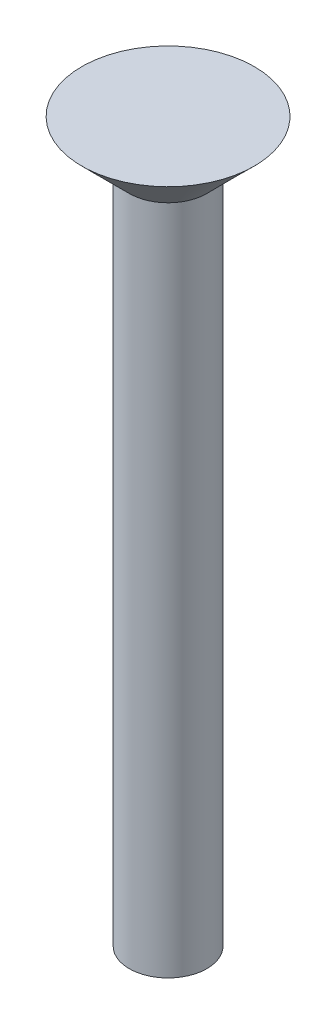
ISO-10303-21;
HEADER;
FILE_DESCRIPTION(('STEP AP214'),'2;1');
FILE_NAME('part.step','',(''),(''),'','','');
FILE_SCHEMA(('AUTOMOTIVE_DESIGN { 1 0 10303 214 1 1 1 1 }'));
ENDSEC;
DATA;
#1=APPLICATION_CONTEXT('core data for automotive mechanical design processes');
#2=APPLICATION_PROTOCOL_DEFINITION('international standard','automotive_design',2000,#1);
#3=PRODUCT_CONTEXT('',#1,'mechanical');
#4=PRODUCT('Part','Part','',(#3));
#5=PRODUCT_RELATED_PRODUCT_CATEGORY('part','',(#4));
#6=PRODUCT_DEFINITION_FORMATION('','',#4);
#7=PRODUCT_DEFINITION_CONTEXT('part definition',#1,'design');
#8=PRODUCT_DEFINITION('design','',#6,#7);
#9=PRODUCT_DEFINITION_SHAPE('','',#8);
#10=(LENGTH_UNIT() NAMED_UNIT(*) SI_UNIT(.MILLI.,.METRE.));
#11=(NAMED_UNIT(*) PLANE_ANGLE_UNIT() SI_UNIT($,.RADIAN.));
#12=(NAMED_UNIT(*) SI_UNIT($,.STERADIAN.) SOLID_ANGLE_UNIT());
#13=UNCERTAINTY_MEASURE_WITH_UNIT(LENGTH_MEASURE(1.E-05),#10,'distance_accuracy_value','');
#14=(GEOMETRIC_REPRESENTATION_CONTEXT(3) GLOBAL_UNCERTAINTY_ASSIGNED_CONTEXT((#13)) GLOBAL_UNIT_ASSIGNED_CONTEXT((#10,
#11,#12)) REPRESENTATION_CONTEXT('',''));
#15=CARTESIAN_POINT('',(0.,0.,0.));
#16=DIRECTION('',(0.,0.,1.));
#17=DIRECTION('',(1.,0.,0.));
#18=AXIS2_PLACEMENT_3D('',#15,#16,#17);
#19=CARTESIAN_POINT('',(1.35,-11.675,0.));
#20=DIRECTION('',(0.,-1.,0.));
#21=DIRECTION('',(0.,0.,-1.));
#22=AXIS2_PLACEMENT_3D('',#19,#20,#21);
#23=PLANE('',#22);
#24=CARTESIAN_POINT('',(0.,-11.675,0.));
#25=DIRECTION('',(0.,-1.,0.));
#26=DIRECTION('',(0.,0.,-1.));
#27=AXIS2_PLACEMENT_3D('',#24,#25,#26);
#28=CIRCLE('',#27,1.35);
#29=CARTESIAN_POINT('',(0.,-11.675,-1.35));
#30=VERTEX_POINT('',#29);
#31=EDGE_CURVE('E10',#30,#30,#28,.T.);
#32=ORIENTED_EDGE('',*,*,#31,.T.);
#33=EDGE_LOOP('',(#32));
#34=FACE_BOUND('',#33,.T.);
#35=ADVANCED_FACE('F37',(#34),#23,.T.);
#36=CARTESIAN_POINT('',(0.,-5.70664739884393,0.));
#37=DIRECTION('',(0.,-1.,0.));
#38=DIRECTION('',(0.,0.,-1.));
#39=AXIS2_PLACEMENT_3D('',#36,#37,#38);
#40=CYLINDRICAL_SURFACE('',#39,1.35);
#41=CARTESIAN_POINT('',(0.,11.675,0.));
#42=DIRECTION('',(0.,-1.,0.));
#43=DIRECTION('',(0.,0.,-1.));
#44=AXIS2_PLACEMENT_3D('',#41,#42,#43);
#45=CIRCLE('',#44,1.35);
#46=CARTESIAN_POINT('',(0.,11.675,-1.35));
#47=VERTEX_POINT('',#46);
#48=EDGE_CURVE('E44',#47,#47,#45,.T.);
#49=ORIENTED_EDGE('',*,*,#48,.T.);
#50=EDGE_LOOP('',(#49));
#51=FACE_BOUND('',#50,.T.);
#52=ORIENTED_EDGE('',*,*,#31,.F.);
#53=EDGE_LOOP('',(#52));
#54=FACE_BOUND('',#53,.T.);
#55=ADVANCED_FACE('F62',(#51,#54),#40,.T.);
#56=CARTESIAN_POINT('',(3.,13.325,0.));
#57=DIRECTION('',(0.,1.,0.));
#58=DIRECTION('',(0.,0.,1.));
#59=AXIS2_PLACEMENT_3D('',#56,#57,#58);
#60=PLANE('',#59);
#61=CARTESIAN_POINT('',(0.,13.325,0.));
#62=DIRECTION('',(0.,-1.,0.));
#63=DIRECTION('',(0.,0.,-1.));
#64=AXIS2_PLACEMENT_3D('',#61,#62,#63);
#65=CIRCLE('',#64,3.);
#66=CARTESIAN_POINT('',(0.,13.325,-3.));
#67=VERTEX_POINT('',#66);
#68=EDGE_CURVE('E49',#67,#67,#65,.T.);
#69=ORIENTED_EDGE('',*,*,#68,.F.);
#70=EDGE_LOOP('',(#69));
#71=FACE_BOUND('',#70,.T.);
#72=ADVANCED_FACE('F60',(#71),#60,.T.);
#73=CARTESIAN_POINT('',(0.,11.675,0.));
#74=DIRECTION('',(0.,1.,0.));
#75=DIRECTION('',(0.,0.,1.));
#76=AXIS2_PLACEMENT_3D('',#73,#74,#75);
#77=CONICAL_SURFACE('',#76,1.35,0.785398163397448);
#78=ORIENTED_EDGE('',*,*,#68,.T.);
#79=EDGE_LOOP('',(#78));
#80=FACE_BOUND('',#79,.T.);
#81=ORIENTED_EDGE('',*,*,#48,.F.);
#82=EDGE_LOOP('',(#81));
#83=FACE_BOUND('',#82,.T.);
#84=ADVANCED_FACE('F57',(#80,#83),#77,.T.);
#85=CLOSED_SHELL('',(#35,#55,#72,#84));
#86=MANIFOLD_SOLID_BREP('B2',#85);
#87=ADVANCED_BREP_SHAPE_REPRESENTATION('',(#18,#86),#14);
#88=SHAPE_DEFINITION_REPRESENTATION(#9,#87);
ENDSEC;
END-ISO-10303-21;
